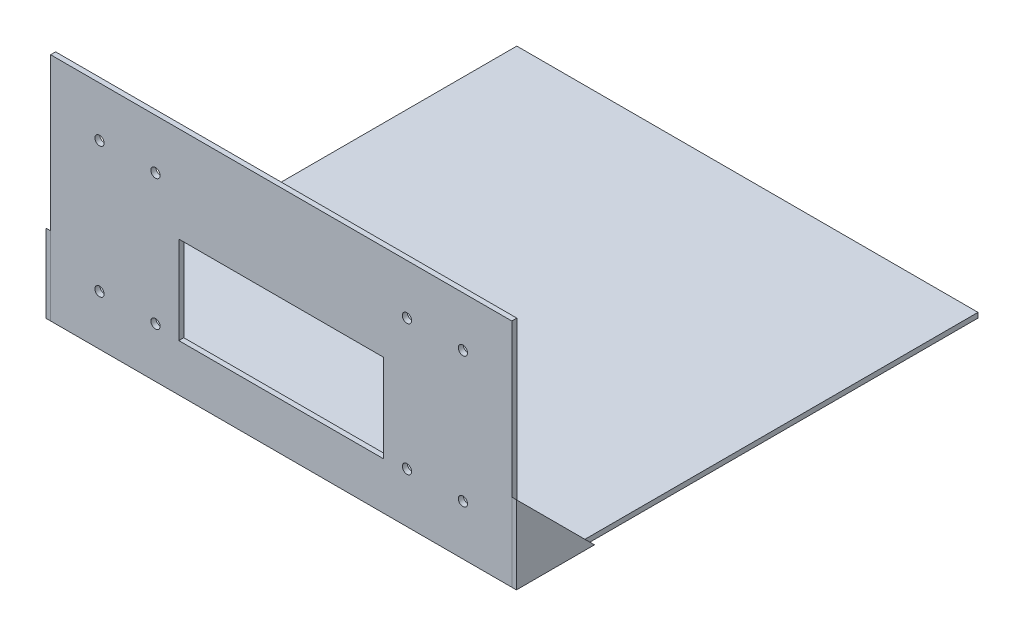
ISO-10303-21;
HEADER;
FILE_DESCRIPTION(('STEP AP214'),'2;1');
FILE_NAME('part.step','',(''),(''),'','','');
FILE_SCHEMA(('AUTOMOTIVE_DESIGN { 1 0 10303 214 1 1 1 1 }'));
ENDSEC;
DATA;
#1=APPLICATION_CONTEXT('core data for automotive mechanical design processes');
#2=APPLICATION_PROTOCOL_DEFINITION('international standard','automotive_design',2000,#1);
#3=PRODUCT_CONTEXT('',#1,'mechanical');
#4=PRODUCT('Part','Part','',(#3));
#5=PRODUCT_RELATED_PRODUCT_CATEGORY('part','',(#4));
#6=PRODUCT_DEFINITION_FORMATION('','',#4);
#7=PRODUCT_DEFINITION_CONTEXT('part definition',#1,'design');
#8=PRODUCT_DEFINITION('design','',#6,#7);
#9=PRODUCT_DEFINITION_SHAPE('','',#8);
#10=(LENGTH_UNIT() NAMED_UNIT(*) SI_UNIT(.MILLI.,.METRE.));
#11=(NAMED_UNIT(*) PLANE_ANGLE_UNIT() SI_UNIT($,.RADIAN.));
#12=(NAMED_UNIT(*) SI_UNIT($,.STERADIAN.) SOLID_ANGLE_UNIT());
#13=UNCERTAINTY_MEASURE_WITH_UNIT(LENGTH_MEASURE(1.E-05),#10,'distance_accuracy_value','');
#14=(GEOMETRIC_REPRESENTATION_CONTEXT(3) GLOBAL_UNCERTAINTY_ASSIGNED_CONTEXT((#13)) GLOBAL_UNIT_ASSIGNED_CONTEXT((#10,
#11,#12)) REPRESENTATION_CONTEXT('',''));
#15=CARTESIAN_POINT('',(0.,0.,0.));
#16=DIRECTION('',(0.,0.,1.));
#17=DIRECTION('',(1.,0.,0.));
#18=AXIS2_PLACEMENT_3D('',#15,#16,#17);
#19=CARTESIAN_POINT('',(-153.,0.,153.25));
#20=DIRECTION('',(0.,0.,1.));
#21=DIRECTION('',(-1.,0.,0.));
#22=AXIS2_PLACEMENT_3D('',#19,#20,#21);
#23=PLANE('',#22);
#24=DIRECTION('',(0.,1.,0.));
#25=VECTOR('',#24,1.);
#26=CARTESIAN_POINT('',(-150.,0.,153.25));
#27=LINE('',#26,#25);
#28=CARTESIAN_POINT('',(-150.,0.,153.25));
#29=VERTEX_POINT('',#28);
#30=CARTESIAN_POINT('',(-150.,50.8,153.25));
#31=VERTEX_POINT('',#30);
#32=EDGE_CURVE('E101',#29,#31,#27,.T.);
#33=ORIENTED_EDGE('',*,*,#32,.T.);
#34=DIRECTION('',(1.,0.,0.));
#35=VECTOR('',#34,1.);
#36=CARTESIAN_POINT('',(-153.,50.8,153.25));
#37=LINE('',#36,#35);
#38=CARTESIAN_POINT('',(-153.,50.8,153.25));
#39=VERTEX_POINT('',#38);
#40=EDGE_CURVE('E55',#39,#31,#37,.T.);
#41=ORIENTED_EDGE('',*,*,#40,.F.);
#42=DIRECTION('',(0.,1.,0.));
#43=VECTOR('',#42,1.);
#44=CARTESIAN_POINT('',(-153.,0.,153.25));
#45=LINE('',#44,#43);
#46=CARTESIAN_POINT('',(-153.,0.,153.25));
#47=VERTEX_POINT('',#46);
#48=EDGE_CURVE('E94',#47,#39,#45,.T.);
#49=ORIENTED_EDGE('',*,*,#48,.F.);
#50=DIRECTION('',(1.,0.,0.));
#51=VECTOR('',#50,1.);
#52=CARTESIAN_POINT('',(-153.,0.,153.25));
#53=LINE('',#52,#51);
#54=EDGE_CURVE('E12',#47,#29,#53,.T.);
#55=ORIENTED_EDGE('',*,*,#54,.T.);
#56=EDGE_LOOP('',(#33,#41,#49,#55));
#57=FACE_BOUND('',#56,.T.);
#58=ADVANCED_FACE('F52',(#57),#23,.T.);
#59=CARTESIAN_POINT('',(-153.,0.,102.45));
#60=DIRECTION('',(0.,-1.,0.));
#61=DIRECTION('',(0.,0.,-1.));
#62=AXIS2_PLACEMENT_3D('',#59,#60,#61);
#63=PLANE('',#62);
#64=DIRECTION('',(0.,0.,1.));
#65=VECTOR('',#64,1.);
#66=CARTESIAN_POINT('',(-150.,0.,102.45));
#67=LINE('',#66,#65);
#68=CARTESIAN_POINT('',(-150.,0.,102.45));
#69=VERTEX_POINT('',#68);
#70=EDGE_CURVE('E88',#69,#29,#67,.T.);
#71=ORIENTED_EDGE('',*,*,#70,.T.);
#72=ORIENTED_EDGE('',*,*,#54,.F.);
#73=DIRECTION('',(0.,0.,1.));
#74=VECTOR('',#73,1.);
#75=CARTESIAN_POINT('',(-153.,0.,102.45));
#76=LINE('',#75,#74);
#77=CARTESIAN_POINT('',(-153.,0.,102.45));
#78=VERTEX_POINT('',#77);
#79=EDGE_CURVE('E70',#78,#47,#76,.T.);
#80=ORIENTED_EDGE('',*,*,#79,.F.);
#81=DIRECTION('',(1.,0.,0.));
#82=VECTOR('',#81,1.);
#83=CARTESIAN_POINT('',(-153.,0.,102.45));
#84=LINE('',#83,#82);
#85=EDGE_CURVE('E61',#78,#69,#84,.T.);
#86=ORIENTED_EDGE('',*,*,#85,.T.);
#87=EDGE_LOOP('',(#71,#72,#80,#86));
#88=FACE_BOUND('',#87,.T.);
#89=ADVANCED_FACE('F106',(#88),#63,.T.);
#90=CARTESIAN_POINT('',(-153.,50.8,153.25));
#91=DIRECTION('',(0.,0.707106781186547,-0.707106781186548));
#92=DIRECTION('',(0.,0.707106781186548,0.707106781186547));
#93=AXIS2_PLACEMENT_3D('',#90,#91,#92);
#94=PLANE('',#93);
#95=DIRECTION('',(0.,-0.707106781186548,-0.707106781186547));
#96=VECTOR('',#95,1.);
#97=CARTESIAN_POINT('',(-150.,50.8,153.25));
#98=LINE('',#97,#96);
#99=EDGE_CURVE('E83',#31,#69,#98,.T.);
#100=ORIENTED_EDGE('',*,*,#99,.T.);
#101=ORIENTED_EDGE('',*,*,#85,.F.);
#102=DIRECTION('',(0.,-0.707106781186548,-0.707106781186547));
#103=VECTOR('',#102,1.);
#104=CARTESIAN_POINT('',(-153.,50.8,153.25));
#105=LINE('',#104,#103);
#106=EDGE_CURVE('E90',#39,#78,#105,.T.);
#107=ORIENTED_EDGE('',*,*,#106,.F.);
#108=ORIENTED_EDGE('',*,*,#40,.T.);
#109=EDGE_LOOP('',(#100,#101,#107,#108));
#110=FACE_BOUND('',#109,.T.);
#111=ADVANCED_FACE('F91',(#110),#94,.T.);
#112=CARTESIAN_POINT('',(-153.,0.,0.));
#113=DIRECTION('',(-1.,0.,0.));
#114=DIRECTION('',(0.,0.,-1.));
#115=AXIS2_PLACEMENT_3D('',#112,#113,#114);
#116=PLANE('',#115);
#117=ORIENTED_EDGE('',*,*,#48,.T.);
#118=ORIENTED_EDGE('',*,*,#106,.T.);
#119=ORIENTED_EDGE('',*,*,#79,.T.);
#120=EDGE_LOOP('',(#117,#118,#119));
#121=FACE_BOUND('',#120,.T.);
#122=ADVANCED_FACE('F97',(#121),#116,.T.);
#123=CARTESIAN_POINT('',(-150.,0.,0.));
#124=DIRECTION('',(-1.,0.,0.));
#125=DIRECTION('',(0.,0.,-1.));
#126=AXIS2_PLACEMENT_3D('',#123,#124,#125);
#127=PLANE('',#126);
#128=ORIENTED_EDGE('',*,*,#32,.F.);
#129=ORIENTED_EDGE('',*,*,#70,.F.);
#130=ORIENTED_EDGE('',*,*,#99,.F.);
#131=EDGE_LOOP('',(#128,#129,#130));
#132=FACE_BOUND('',#131,.T.);
#133=ADVANCED_FACE('F108',(#132),#127,.F.);
#134=CLOSED_SHELL('',(#58,#89,#111,#122,#133));
#135=MANIFOLD_SOLID_BREP('B2',#134);
#136=CARTESIAN_POINT('',(153.,0.,153.25));
#137=DIRECTION('',(0.,0.,1.));
#138=DIRECTION('',(1.,0.,0.));
#139=AXIS2_PLACEMENT_3D('',#136,#137,#138);
#140=PLANE('',#139);
#141=DIRECTION('',(0.,1.,0.));
#142=VECTOR('',#141,1.);
#143=CARTESIAN_POINT('',(150.,0.,153.25));
#144=LINE('',#143,#142);
#145=CARTESIAN_POINT('',(150.,0.,153.25));
#146=VERTEX_POINT('',#145);
#147=CARTESIAN_POINT('',(150.,50.8,153.25));
#148=VERTEX_POINT('',#147);
#149=EDGE_CURVE('E212',#146,#148,#144,.T.);
#150=ORIENTED_EDGE('',*,*,#149,.F.);
#151=DIRECTION('',(-1.,0.,0.));
#152=VECTOR('',#151,1.);
#153=CARTESIAN_POINT('',(153.,0.,153.25));
#154=LINE('',#153,#152);
#155=CARTESIAN_POINT('',(153.,0.,153.25));
#156=VERTEX_POINT('',#155);
#157=EDGE_CURVE('E50',#156,#146,#154,.T.);
#158=ORIENTED_EDGE('',*,*,#157,.F.);
#159=DIRECTION('',(0.,1.,0.));
#160=VECTOR('',#159,1.);
#161=CARTESIAN_POINT('',(153.,0.,153.25));
#162=LINE('',#161,#160);
#163=CARTESIAN_POINT('',(153.,50.8,153.25));
#164=VERTEX_POINT('',#163);
#165=EDGE_CURVE('E204',#156,#164,#162,.T.);
#166=ORIENTED_EDGE('',*,*,#165,.T.);
#167=DIRECTION('',(-1.,0.,0.));
#168=VECTOR('',#167,1.);
#169=CARTESIAN_POINT('',(153.,50.8,153.25));
#170=LINE('',#169,#168);
#171=EDGE_CURVE('E163',#164,#148,#170,.T.);
#172=ORIENTED_EDGE('',*,*,#171,.T.);
#173=EDGE_LOOP('',(#150,#158,#166,#172));
#174=FACE_BOUND('',#173,.T.);
#175=ADVANCED_FACE('F160',(#174),#140,.T.);
#176=CARTESIAN_POINT('',(153.,0.,102.45));
#177=DIRECTION('',(0.,-1.,0.));
#178=DIRECTION('',(0.,0.,-1.));
#179=AXIS2_PLACEMENT_3D('',#176,#177,#178);
#180=PLANE('',#179);
#181=DIRECTION('',(0.,0.,1.));
#182=VECTOR('',#181,1.);
#183=CARTESIAN_POINT('',(150.,0.,102.45));
#184=LINE('',#183,#182);
#185=CARTESIAN_POINT('',(150.,0.,102.45));
#186=VERTEX_POINT('',#185);
#187=EDGE_CURVE('E206',#186,#146,#184,.T.);
#188=ORIENTED_EDGE('',*,*,#187,.F.);
#189=DIRECTION('',(-1.,0.,0.));
#190=VECTOR('',#189,1.);
#191=CARTESIAN_POINT('',(153.,0.,102.45));
#192=LINE('',#191,#190);
#193=CARTESIAN_POINT('',(153.,0.,102.45));
#194=VERTEX_POINT('',#193);
#195=EDGE_CURVE('E169',#194,#186,#192,.T.);
#196=ORIENTED_EDGE('',*,*,#195,.F.);
#197=DIRECTION('',(0.,0.,1.));
#198=VECTOR('',#197,1.);
#199=CARTESIAN_POINT('',(153.,0.,102.45));
#200=LINE('',#199,#198);
#201=EDGE_CURVE('E201',#194,#156,#200,.T.);
#202=ORIENTED_EDGE('',*,*,#201,.T.);
#203=ORIENTED_EDGE('',*,*,#157,.T.);
#204=EDGE_LOOP('',(#188,#196,#202,#203));
#205=FACE_BOUND('',#204,.T.);
#206=ADVANCED_FACE('F216',(#205),#180,.T.);
#207=CARTESIAN_POINT('',(153.,50.8,153.25));
#208=DIRECTION('',(0.,0.707106781186547,-0.707106781186548));
#209=DIRECTION('',(0.,0.707106781186548,0.707106781186547));
#210=AXIS2_PLACEMENT_3D('',#207,#208,#209);
#211=PLANE('',#210);
#212=DIRECTION('',(0.,-0.707106781186548,-0.707106781186547));
#213=VECTOR('',#212,1.);
#214=CARTESIAN_POINT('',(150.,50.8,153.25));
#215=LINE('',#214,#213);
#216=EDGE_CURVE('E199',#148,#186,#215,.T.);
#217=ORIENTED_EDGE('',*,*,#216,.F.);
#218=ORIENTED_EDGE('',*,*,#171,.F.);
#219=DIRECTION('',(0.,-0.707106781186548,-0.707106781186547));
#220=VECTOR('',#219,1.);
#221=CARTESIAN_POINT('',(153.,50.8,153.25));
#222=LINE('',#221,#220);
#223=EDGE_CURVE('E197',#164,#194,#222,.T.);
#224=ORIENTED_EDGE('',*,*,#223,.T.);
#225=ORIENTED_EDGE('',*,*,#195,.T.);
#226=EDGE_LOOP('',(#217,#218,#224,#225));
#227=FACE_BOUND('',#226,.T.);
#228=ADVANCED_FACE('F196',(#227),#211,.T.);
#229=CARTESIAN_POINT('',(153.,0.,0.));
#230=DIRECTION('',(1.,0.,0.));
#231=DIRECTION('',(0.,0.,-1.));
#232=AXIS2_PLACEMENT_3D('',#229,#230,#231);
#233=PLANE('',#232);
#234=ORIENTED_EDGE('',*,*,#165,.F.);
#235=ORIENTED_EDGE('',*,*,#201,.F.);
#236=ORIENTED_EDGE('',*,*,#223,.F.);
#237=EDGE_LOOP('',(#234,#235,#236));
#238=FACE_BOUND('',#237,.T.);
#239=ADVANCED_FACE('F203',(#238),#233,.T.);
#240=CARTESIAN_POINT('',(150.,0.,0.));
#241=DIRECTION('',(1.,0.,0.));
#242=DIRECTION('',(0.,0.,-1.));
#243=AXIS2_PLACEMENT_3D('',#240,#241,#242);
#244=PLANE('',#243);
#245=ORIENTED_EDGE('',*,*,#149,.T.);
#246=ORIENTED_EDGE('',*,*,#216,.T.);
#247=ORIENTED_EDGE('',*,*,#187,.T.);
#248=EDGE_LOOP('',(#245,#246,#247));
#249=FACE_BOUND('',#248,.T.);
#250=ADVANCED_FACE('F215',(#249),#244,.F.);
#251=CLOSED_SHELL('',(#175,#206,#228,#239,#250));
#252=MANIFOLD_SOLID_BREP('B6',#251);
#253=CARTESIAN_POINT('',(150.,0.,153.25));
#254=DIRECTION('',(-1.,0.,0.));
#255=DIRECTION('',(0.,0.,1.));
#256=AXIS2_PLACEMENT_3D('',#253,#254,#255);
#257=PLANE('',#256);
#258=DIRECTION('',(0.,1.,0.));
#259=VECTOR('',#258,1.);
#260=CARTESIAN_POINT('',(150.,0.,150.));
#261=LINE('',#260,#259);
#262=CARTESIAN_POINT('',(150.,0.,150.));
#263=VERTEX_POINT('',#262);
#264=CARTESIAN_POINT('',(150.,150.,150.));
#265=VERTEX_POINT('',#264);
#266=EDGE_CURVE('E379',#263,#265,#261,.T.);
#267=ORIENTED_EDGE('',*,*,#266,.T.);
#268=DIRECTION('',(0.,0.,-1.));
#269=VECTOR('',#268,1.);
#270=CARTESIAN_POINT('',(150.,150.,153.25));
#271=LINE('',#270,#269);
#272=CARTESIAN_POINT('',(150.,150.,153.25));
#273=VERTEX_POINT('',#272);
#274=EDGE_CURVE('E158',#273,#265,#271,.T.);
#275=ORIENTED_EDGE('',*,*,#274,.F.);
#276=DIRECTION('',(0.,1.,0.));
#277=VECTOR('',#276,1.);
#278=CARTESIAN_POINT('',(150.,0.,153.25));
#279=LINE('',#278,#277);
#280=CARTESIAN_POINT('',(150.,0.,153.25));
#281=VERTEX_POINT('',#280);
#282=EDGE_CURVE('E383',#281,#273,#279,.T.);
#283=ORIENTED_EDGE('',*,*,#282,.F.);
#284=DIRECTION('',(0.,0.,-1.));
#285=VECTOR('',#284,1.);
#286=CARTESIAN_POINT('',(150.,0.,153.25));
#287=LINE('',#286,#285);
#288=EDGE_CURVE('E395',#281,#263,#287,.T.);
#289=ORIENTED_EDGE('',*,*,#288,.T.);
#290=EDGE_LOOP('',(#267,#275,#283,#289));
#291=FACE_BOUND('',#290,.T.);
#292=ADVANCED_FACE('F267',(#291),#257,.F.);
#293=CARTESIAN_POINT('',(150.,150.,153.25));
#294=DIRECTION('',(0.,-1.,0.));
#295=DIRECTION('',(1.,0.,0.));
#296=AXIS2_PLACEMENT_3D('',#293,#294,#295);
#297=PLANE('',#296);
#298=DIRECTION('',(-1.,0.,0.));
#299=VECTOR('',#298,1.);
#300=CARTESIAN_POINT('',(150.,150.,150.));
#301=LINE('',#300,#299);
#302=CARTESIAN_POINT('',(-150.,150.,150.));
#303=VERTEX_POINT('',#302);
#304=EDGE_CURVE('E398',#265,#303,#301,.T.);
#305=ORIENTED_EDGE('',*,*,#304,.T.);
#306=DIRECTION('',(0.,0.,-1.));
#307=VECTOR('',#306,1.);
#308=CARTESIAN_POINT('',(-150.,150.,153.25));
#309=LINE('',#308,#307);
#310=CARTESIAN_POINT('',(-150.,150.,153.25));
#311=VERTEX_POINT('',#310);
#312=EDGE_CURVE('E275',#311,#303,#309,.T.);
#313=ORIENTED_EDGE('',*,*,#312,.F.);
#314=DIRECTION('',(-1.,0.,0.));
#315=VECTOR('',#314,1.);
#316=CARTESIAN_POINT('',(150.,150.,153.25));
#317=LINE('',#316,#315);
#318=EDGE_CURVE('E386',#273,#311,#317,.T.);
#319=ORIENTED_EDGE('',*,*,#318,.F.);
#320=ORIENTED_EDGE('',*,*,#274,.T.);
#321=EDGE_LOOP('',(#305,#313,#319,#320));
#322=FACE_BOUND('',#321,.T.);
#323=ADVANCED_FACE('F461',(#322),#297,.F.);
#324=CARTESIAN_POINT('',(-150.,0.,153.25));
#325=DIRECTION('',(1.,0.,0.));
#326=DIRECTION('',(0.,0.,-1.));
#327=AXIS2_PLACEMENT_3D('',#324,#325,#326);
#328=PLANE('',#327);
#329=DIRECTION('',(0.,-1.,0.));
#330=VECTOR('',#329,1.);
#331=CARTESIAN_POINT('',(-150.,0.,150.));
#332=LINE('',#331,#330);
#333=CARTESIAN_POINT('',(-150.,0.,150.));
#334=VERTEX_POINT('',#333);
#335=EDGE_CURVE('E401',#303,#334,#332,.T.);
#336=ORIENTED_EDGE('',*,*,#335,.T.);
#337=DIRECTION('',(0.,0.,-1.));
#338=VECTOR('',#337,1.);
#339=CARTESIAN_POINT('',(-150.,0.,153.25));
#340=LINE('',#339,#338);
#341=CARTESIAN_POINT('',(-150.,0.,153.25));
#342=VERTEX_POINT('',#341);
#343=EDGE_CURVE('E407',#342,#334,#340,.T.);
#344=ORIENTED_EDGE('',*,*,#343,.F.);
#345=DIRECTION('',(0.,-1.,0.));
#346=VECTOR('',#345,1.);
#347=CARTESIAN_POINT('',(-150.,0.,153.25));
#348=LINE('',#347,#346);
#349=EDGE_CURVE('E390',#311,#342,#348,.T.);
#350=ORIENTED_EDGE('',*,*,#349,.F.);
#351=ORIENTED_EDGE('',*,*,#312,.T.);
#352=EDGE_LOOP('',(#336,#344,#350,#351));
#353=FACE_BOUND('',#352,.T.);
#354=ADVANCED_FACE('F466',(#353),#328,.F.);
#355=CARTESIAN_POINT('',(150.,0.,153.25));
#356=DIRECTION('',(0.,1.,0.));
#357=DIRECTION('',(0.,0.,1.));
#358=AXIS2_PLACEMENT_3D('',#355,#356,#357);
#359=PLANE('',#358);
#360=DIRECTION('',(1.,0.,0.));
#361=VECTOR('',#360,1.);
#362=CARTESIAN_POINT('',(150.,0.,150.));
#363=LINE('',#362,#361);
#364=EDGE_CURVE('E387',#334,#263,#363,.T.);
#365=ORIENTED_EDGE('',*,*,#364,.T.);
#366=ORIENTED_EDGE('',*,*,#288,.F.);
#367=DIRECTION('',(1.,0.,0.));
#368=VECTOR('',#367,1.);
#369=CARTESIAN_POINT('',(150.,0.,153.25));
#370=LINE('',#369,#368);
#371=EDGE_CURVE('E393',#342,#281,#370,.T.);
#372=ORIENTED_EDGE('',*,*,#371,.F.);
#373=ORIENTED_EDGE('',*,*,#343,.T.);
#374=EDGE_LOOP('',(#365,#366,#372,#373));
#375=FACE_BOUND('',#374,.T.);
#376=ADVANCED_FACE('F448',(#375),#359,.F.);
#377=CARTESIAN_POINT('',(0.,0.,153.25));
#378=DIRECTION('',(0.,0.,1.));
#379=DIRECTION('',(1.,0.,0.));
#380=AXIS2_PLACEMENT_3D('',#377,#378,#379);
#381=PLANE('',#380);
#382=CARTESIAN_POINT('',(118.203411960363,117.56753958833,153.25));
#383=DIRECTION('',(0.,0.,1.));
#384=DIRECTION('',(1.,0.,0.));
#385=AXIS2_PLACEMENT_3D('',#382,#383,#384);
#386=CIRCLE('',#385,3.00000000000001);
#387=CARTESIAN_POINT('',(121.203411960363,117.56753958833,153.25));
#388=VERTEX_POINT('',#387);
#389=EDGE_CURVE('E420',#388,#388,#386,.T.);
#390=ORIENTED_EDGE('',*,*,#389,.F.);
#391=EDGE_LOOP('',(#390));
#392=FACE_BOUND('',#391,.T.);
#393=CARTESIAN_POINT('',(118.203411960363,32.5675395883299,153.25));
#394=DIRECTION('',(0.,0.,1.));
#395=DIRECTION('',(1.,0.,0.));
#396=AXIS2_PLACEMENT_3D('',#393,#394,#395);
#397=CIRCLE('',#396,3.00000000000001);
#398=CARTESIAN_POINT('',(121.203411960363,32.5675395883299,153.25));
#399=VERTEX_POINT('',#398);
#400=EDGE_CURVE('E620',#399,#399,#397,.T.);
#401=ORIENTED_EDGE('',*,*,#400,.F.);
#402=EDGE_LOOP('',(#401));
#403=FACE_BOUND('',#402,.T.);
#404=CARTESIAN_POINT('',(81.7965880396367,32.5675395883299,153.25));
#405=DIRECTION('',(0.,0.,1.));
#406=DIRECTION('',(1.,0.,0.));
#407=AXIS2_PLACEMENT_3D('',#404,#405,#406);
#408=CIRCLE('',#407,3.00000000000001);
#409=CARTESIAN_POINT('',(84.7965880396367,32.5675395883299,153.25));
#410=VERTEX_POINT('',#409);
#411=EDGE_CURVE('E623',#410,#410,#408,.T.);
#412=ORIENTED_EDGE('',*,*,#411,.F.);
#413=EDGE_LOOP('',(#412));
#414=FACE_BOUND('',#413,.T.);
#415=CARTESIAN_POINT('',(-81.7965880396367,32.5675395883299,153.25));
#416=DIRECTION('',(0.,0.,1.));
#417=DIRECTION('',(1.,0.,0.));
#418=AXIS2_PLACEMENT_3D('',#415,#416,#417);
#419=CIRCLE('',#418,3.00000000000001);
#420=CARTESIAN_POINT('',(-78.7965880396367,32.5675395883299,153.25));
#421=VERTEX_POINT('',#420);
#422=EDGE_CURVE('E628',#421,#421,#419,.T.);
#423=ORIENTED_EDGE('',*,*,#422,.F.);
#424=EDGE_LOOP('',(#423));
#425=FACE_BOUND('',#424,.T.);
#426=CARTESIAN_POINT('',(-118.203411960363,32.5675395883299,153.25));
#427=DIRECTION('',(0.,0.,1.));
#428=DIRECTION('',(1.,0.,0.));
#429=AXIS2_PLACEMENT_3D('',#426,#427,#428);
#430=CIRCLE('',#429,3.00000000000001);
#431=CARTESIAN_POINT('',(-115.203411960363,32.5675395883299,153.25));
#432=VERTEX_POINT('',#431);
#433=EDGE_CURVE('E631',#432,#432,#430,.T.);
#434=ORIENTED_EDGE('',*,*,#433,.F.);
#435=EDGE_LOOP('',(#434));
#436=FACE_BOUND('',#435,.T.);
#437=CARTESIAN_POINT('',(-118.203411960363,117.56753958833,153.25));
#438=DIRECTION('',(0.,0.,1.));
#439=DIRECTION('',(1.,0.,0.));
#440=AXIS2_PLACEMENT_3D('',#437,#438,#439);
#441=CIRCLE('',#440,3.00000000000001);
#442=CARTESIAN_POINT('',(-115.203411960363,117.56753958833,153.25));
#443=VERTEX_POINT('',#442);
#444=EDGE_CURVE('E634',#443,#443,#441,.T.);
#445=ORIENTED_EDGE('',*,*,#444,.F.);
#446=EDGE_LOOP('',(#445));
#447=FACE_BOUND('',#446,.T.);
#448=CARTESIAN_POINT('',(-81.7965880396367,117.56753958833,153.25));
#449=DIRECTION('',(0.,0.,1.));
#450=DIRECTION('',(1.,0.,0.));
#451=AXIS2_PLACEMENT_3D('',#448,#449,#450);
#452=CIRCLE('',#451,3.00000000000001);
#453=CARTESIAN_POINT('',(-78.7965880396367,117.56753958833,153.25));
#454=VERTEX_POINT('',#453);
#455=EDGE_CURVE('E637',#454,#454,#452,.T.);
#456=ORIENTED_EDGE('',*,*,#455,.F.);
#457=EDGE_LOOP('',(#456));
#458=FACE_BOUND('',#457,.T.);
#459=CARTESIAN_POINT('',(81.7965880396367,117.56753958833,153.25));
#460=DIRECTION('',(0.,0.,1.));
#461=DIRECTION('',(1.,0.,0.));
#462=AXIS2_PLACEMENT_3D('',#459,#460,#461);
#463=CIRCLE('',#462,3.00000000000001);
#464=CARTESIAN_POINT('',(84.7965880396367,117.56753958833,153.25));
#465=VERTEX_POINT('',#464);
#466=EDGE_CURVE('E364',#465,#465,#463,.T.);
#467=ORIENTED_EDGE('',*,*,#466,.F.);
#468=EDGE_LOOP('',(#467));
#469=FACE_BOUND('',#468,.T.);
#470=DIRECTION('',(0.,-1.,0.));
#471=VECTOR('',#470,1.);
#472=CARTESIAN_POINT('',(-66.6162905771802,30.650602214716,153.25));
#473=LINE('',#472,#471);
#474=CARTESIAN_POINT('',(-66.6162905771802,87.8493812812109,153.25));
#475=VERTEX_POINT('',#474);
#476=CARTESIAN_POINT('',(-66.6162905771802,30.650602214716,153.25));
#477=VERTEX_POINT('',#476);
#478=EDGE_CURVE('E283',#475,#477,#473,.T.);
#479=ORIENTED_EDGE('',*,*,#478,.F.);
#480=DIRECTION('',(-1.,0.,0.));
#481=VECTOR('',#480,1.);
#482=CARTESIAN_POINT('',(66.6162905742886,87.849381281211,153.25));
#483=LINE('',#482,#481);
#484=CARTESIAN_POINT('',(66.6162905742886,87.849381281211,153.25));
#485=VERTEX_POINT('',#484);
#486=EDGE_CURVE('E356',#485,#475,#483,.T.);
#487=ORIENTED_EDGE('',*,*,#486,.F.);
#488=DIRECTION('',(0.,1.,0.));
#489=VECTOR('',#488,1.);
#490=CARTESIAN_POINT('',(66.6162905742886,30.650602214716,153.25));
#491=LINE('',#490,#489);
#492=CARTESIAN_POINT('',(66.6162905742886,30.650602214716,153.25));
#493=VERTEX_POINT('',#492);
#494=EDGE_CURVE('E361',#493,#485,#491,.T.);
#495=ORIENTED_EDGE('',*,*,#494,.F.);
#496=DIRECTION('',(1.,0.,0.));
#497=VECTOR('',#496,1.);
#498=CARTESIAN_POINT('',(66.6162905742886,30.650602214716,153.25));
#499=LINE('',#498,#497);
#500=EDGE_CURVE('E371',#477,#493,#499,.T.);
#501=ORIENTED_EDGE('',*,*,#500,.F.);
#502=EDGE_LOOP('',(#479,#487,#495,#501));
#503=FACE_BOUND('',#502,.T.);
#504=ORIENTED_EDGE('',*,*,#282,.T.);
#505=ORIENTED_EDGE('',*,*,#318,.T.);
#506=ORIENTED_EDGE('',*,*,#349,.T.);
#507=ORIENTED_EDGE('',*,*,#371,.T.);
#508=EDGE_LOOP('',(#504,#505,#506,#507));
#509=FACE_BOUND('',#508,.T.);
#510=ADVANCED_FACE('F445',(#392,#403,#414,#425,#436,#447,#458,#469,#503,#509),#381,.T.);
#511=CARTESIAN_POINT('',(0.,0.,150.));
#512=DIRECTION('',(0.,0.,1.));
#513=DIRECTION('',(1.,0.,0.));
#514=AXIS2_PLACEMENT_3D('',#511,#512,#513);
#515=PLANE('',#514);
#516=CARTESIAN_POINT('',(118.203411960363,117.56753958833,150.));
#517=DIRECTION('',(0.,0.,1.));
#518=DIRECTION('',(1.,0.,0.));
#519=AXIS2_PLACEMENT_3D('',#516,#517,#518);
#520=CIRCLE('',#519,3.00000000000001);
#521=CARTESIAN_POINT('',(121.203411960363,117.56753958833,150.));
#522=VERTEX_POINT('',#521);
#523=EDGE_CURVE('E270',#522,#522,#520,.F.);
#524=ORIENTED_EDGE('',*,*,#523,.F.);
#525=EDGE_LOOP('',(#524));
#526=FACE_BOUND('',#525,.T.);
#527=CARTESIAN_POINT('',(118.203411960363,32.5675395883299,150.));
#528=DIRECTION('',(0.,0.,1.));
#529=DIRECTION('',(1.,0.,0.));
#530=AXIS2_PLACEMENT_3D('',#527,#528,#529);
#531=CIRCLE('',#530,3.00000000000001);
#532=CARTESIAN_POINT('',(121.203411960363,32.5675395883299,150.));
#533=VERTEX_POINT('',#532);
#534=EDGE_CURVE('E432',#533,#533,#531,.F.);
#535=ORIENTED_EDGE('',*,*,#534,.F.);
#536=EDGE_LOOP('',(#535));
#537=FACE_BOUND('',#536,.T.);
#538=CARTESIAN_POINT('',(81.7965880396367,32.5675395883299,150.));
#539=DIRECTION('',(0.,0.,1.));
#540=DIRECTION('',(1.,0.,0.));
#541=AXIS2_PLACEMENT_3D('',#538,#539,#540);
#542=CIRCLE('',#541,3.00000000000001);
#543=CARTESIAN_POINT('',(84.7965880396367,32.5675395883299,150.));
#544=VERTEX_POINT('',#543);
#545=EDGE_CURVE('E430',#544,#544,#542,.F.);
#546=ORIENTED_EDGE('',*,*,#545,.F.);
#547=EDGE_LOOP('',(#546));
#548=FACE_BOUND('',#547,.T.);
#549=CARTESIAN_POINT('',(-81.7965880396367,32.5675395883299,150.));
#550=DIRECTION('',(0.,0.,1.));
#551=DIRECTION('',(1.,0.,0.));
#552=AXIS2_PLACEMENT_3D('',#549,#550,#551);
#553=CIRCLE('',#552,3.00000000000001);
#554=CARTESIAN_POINT('',(-78.7965880396367,32.5675395883299,150.));
#555=VERTEX_POINT('',#554);
#556=EDGE_CURVE('E427',#555,#555,#553,.F.);
#557=ORIENTED_EDGE('',*,*,#556,.F.);
#558=EDGE_LOOP('',(#557));
#559=FACE_BOUND('',#558,.T.);
#560=CARTESIAN_POINT('',(-118.203411960363,32.5675395883299,150.));
#561=DIRECTION('',(0.,0.,1.));
#562=DIRECTION('',(1.,0.,0.));
#563=AXIS2_PLACEMENT_3D('',#560,#561,#562);
#564=CIRCLE('',#563,3.00000000000001);
#565=CARTESIAN_POINT('',(-115.203411960363,32.5675395883299,150.));
#566=VERTEX_POINT('',#565);
#567=EDGE_CURVE('E424',#566,#566,#564,.F.);
#568=ORIENTED_EDGE('',*,*,#567,.F.);
#569=EDGE_LOOP('',(#568));
#570=FACE_BOUND('',#569,.T.);
#571=CARTESIAN_POINT('',(-118.203411960363,117.56753958833,150.));
#572=DIRECTION('',(0.,0.,1.));
#573=DIRECTION('',(1.,0.,0.));
#574=AXIS2_PLACEMENT_3D('',#571,#572,#573);
#575=CIRCLE('',#574,3.00000000000001);
#576=CARTESIAN_POINT('',(-115.203411960363,117.56753958833,150.));
#577=VERTEX_POINT('',#576);
#578=EDGE_CURVE('E419',#577,#577,#575,.F.);
#579=ORIENTED_EDGE('',*,*,#578,.F.);
#580=EDGE_LOOP('',(#579));
#581=FACE_BOUND('',#580,.T.);
#582=CARTESIAN_POINT('',(-81.7965880396367,117.56753958833,150.));
#583=DIRECTION('',(0.,0.,1.));
#584=DIRECTION('',(1.,0.,0.));
#585=AXIS2_PLACEMENT_3D('',#582,#583,#584);
#586=CIRCLE('',#585,3.00000000000001);
#587=CARTESIAN_POINT('',(-78.7965880396367,117.56753958833,150.));
#588=VERTEX_POINT('',#587);
#589=EDGE_CURVE('E415',#588,#588,#586,.F.);
#590=ORIENTED_EDGE('',*,*,#589,.F.);
#591=EDGE_LOOP('',(#590));
#592=FACE_BOUND('',#591,.T.);
#593=CARTESIAN_POINT('',(81.7965880396367,117.56753958833,150.));
#594=DIRECTION('',(0.,0.,1.));
#595=DIRECTION('',(1.,0.,0.));
#596=AXIS2_PLACEMENT_3D('',#593,#594,#595);
#597=CIRCLE('',#596,3.00000000000001);
#598=CARTESIAN_POINT('',(84.7965880396367,117.56753958833,150.));
#599=VERTEX_POINT('',#598);
#600=EDGE_CURVE('E372',#599,#599,#597,.F.);
#601=ORIENTED_EDGE('',*,*,#600,.F.);
#602=EDGE_LOOP('',(#601));
#603=FACE_BOUND('',#602,.T.);
#604=DIRECTION('',(-1.,0.,0.));
#605=VECTOR('',#604,1.);
#606=CARTESIAN_POINT('',(66.6162905742886,87.849381281211,150.));
#607=LINE('',#606,#605);
#608=CARTESIAN_POINT('',(66.6162905742886,87.849381281211,150.));
#609=VERTEX_POINT('',#608);
#610=CARTESIAN_POINT('',(-66.6162905771802,87.8493812812109,150.));
#611=VERTEX_POINT('',#610);
#612=EDGE_CURVE('E345',#609,#611,#607,.T.);
#613=ORIENTED_EDGE('',*,*,#612,.T.);
#614=DIRECTION('',(0.,-1.,0.));
#615=VECTOR('',#614,1.);
#616=CARTESIAN_POINT('',(-66.6162905771802,30.650602214716,150.));
#617=LINE('',#616,#615);
#618=CARTESIAN_POINT('',(-66.6162905771802,30.650602214716,150.));
#619=VERTEX_POINT('',#618);
#620=EDGE_CURVE('E339',#611,#619,#617,.T.);
#621=ORIENTED_EDGE('',*,*,#620,.T.);
#622=DIRECTION('',(1.,0.,0.));
#623=VECTOR('',#622,1.);
#624=CARTESIAN_POINT('',(66.6162905742886,30.650602214716,150.));
#625=LINE('',#624,#623);
#626=CARTESIAN_POINT('',(66.6162905742886,30.650602214716,150.));
#627=VERTEX_POINT('',#626);
#628=EDGE_CURVE('E348',#619,#627,#625,.T.);
#629=ORIENTED_EDGE('',*,*,#628,.T.);
#630=DIRECTION('',(0.,1.,0.));
#631=VECTOR('',#630,1.);
#632=CARTESIAN_POINT('',(66.6162905742886,30.650602214716,150.));
#633=LINE('',#632,#631);
#634=EDGE_CURVE('E291',#627,#609,#633,.T.);
#635=ORIENTED_EDGE('',*,*,#634,.T.);
#636=EDGE_LOOP('',(#613,#621,#629,#635));
#637=FACE_BOUND('',#636,.T.);
#638=ORIENTED_EDGE('',*,*,#266,.F.);
#639=ORIENTED_EDGE('',*,*,#364,.F.);
#640=ORIENTED_EDGE('',*,*,#335,.F.);
#641=ORIENTED_EDGE('',*,*,#304,.F.);
#642=EDGE_LOOP('',(#638,#639,#640,#641));
#643=FACE_BOUND('',#642,.T.);
#644=ADVANCED_FACE('F352',(#526,#537,#548,#559,#570,#581,#592,#603,#637,#643),#515,.F.);
#645=CARTESIAN_POINT('',(-66.6162905771802,30.650602214716,150.));
#646=DIRECTION('',(-1.,0.,0.));
#647=DIRECTION('',(0.,0.,1.));
#648=AXIS2_PLACEMENT_3D('',#645,#646,#647);
#649=PLANE('',#648);
#650=ORIENTED_EDGE('',*,*,#478,.T.);
#651=DIRECTION('',(0.,0.,1.));
#652=VECTOR('',#651,1.);
#653=CARTESIAN_POINT('',(-66.6162905771802,30.650602214716,150.));
#654=LINE('',#653,#652);
#655=EDGE_CURVE('E335',#619,#477,#654,.T.);
#656=ORIENTED_EDGE('',*,*,#655,.F.);
#657=ORIENTED_EDGE('',*,*,#620,.F.);
#658=DIRECTION('',(0.,0.,1.));
#659=VECTOR('',#658,1.);
#660=CARTESIAN_POINT('',(-66.6162905771802,87.8493812812109,150.));
#661=LINE('',#660,#659);
#662=EDGE_CURVE('E376',#611,#475,#661,.T.);
#663=ORIENTED_EDGE('',*,*,#662,.T.);
#664=EDGE_LOOP('',(#650,#656,#657,#663));
#665=FACE_BOUND('',#664,.T.);
#666=ADVANCED_FACE('F337',(#665),#649,.F.);
#667=CARTESIAN_POINT('',(66.6162905742886,87.849381281211,150.));
#668=DIRECTION('',(0.,1.,0.));
#669=DIRECTION('',(-1.,0.,0.));
#670=AXIS2_PLACEMENT_3D('',#667,#668,#669);
#671=PLANE('',#670);
#672=ORIENTED_EDGE('',*,*,#486,.T.);
#673=ORIENTED_EDGE('',*,*,#662,.F.);
#674=ORIENTED_EDGE('',*,*,#612,.F.);
#675=DIRECTION('',(0.,0.,1.));
#676=VECTOR('',#675,1.);
#677=CARTESIAN_POINT('',(66.6162905742886,87.849381281211,150.));
#678=LINE('',#677,#676);
#679=EDGE_CURVE('E380',#609,#485,#678,.T.);
#680=ORIENTED_EDGE('',*,*,#679,.T.);
#681=EDGE_LOOP('',(#672,#673,#674,#680));
#682=FACE_BOUND('',#681,.T.);
#683=ADVANCED_FACE('F475',(#682),#671,.F.);
#684=CARTESIAN_POINT('',(66.6162905742886,30.650602214716,150.));
#685=DIRECTION('',(1.,0.,0.));
#686=DIRECTION('',(0.,0.,-1.));
#687=AXIS2_PLACEMENT_3D('',#684,#685,#686);
#688=PLANE('',#687);
#689=ORIENTED_EDGE('',*,*,#494,.T.);
#690=ORIENTED_EDGE('',*,*,#679,.F.);
#691=ORIENTED_EDGE('',*,*,#634,.F.);
#692=DIRECTION('',(0.,0.,1.));
#693=VECTOR('',#692,1.);
#694=CARTESIAN_POINT('',(66.6162905742886,30.650602214716,150.));
#695=LINE('',#694,#693);
#696=EDGE_CURVE('E344',#627,#493,#695,.T.);
#697=ORIENTED_EDGE('',*,*,#696,.T.);
#698=EDGE_LOOP('',(#689,#690,#691,#697));
#699=FACE_BOUND('',#698,.T.);
#700=ADVANCED_FACE('F594',(#699),#688,.F.);
#701=CARTESIAN_POINT('',(66.6162905742886,30.650602214716,150.));
#702=DIRECTION('',(0.,-1.,0.));
#703=DIRECTION('',(1.,0.,0.));
#704=AXIS2_PLACEMENT_3D('',#701,#702,#703);
#705=PLANE('',#704);
#706=ORIENTED_EDGE('',*,*,#500,.T.);
#707=ORIENTED_EDGE('',*,*,#696,.F.);
#708=ORIENTED_EDGE('',*,*,#628,.F.);
#709=ORIENTED_EDGE('',*,*,#655,.T.);
#710=EDGE_LOOP('',(#706,#707,#708,#709));
#711=FACE_BOUND('',#710,.T.);
#712=ADVANCED_FACE('F349',(#711),#705,.F.);
#713=CARTESIAN_POINT('',(81.7965880396367,117.56753958833,153.25));
#714=DIRECTION('',(0.,0.,-1.));
#715=DIRECTION('',(-1.,0.,0.));
#716=AXIS2_PLACEMENT_3D('',#713,#714,#715);
#717=CYLINDRICAL_SURFACE('',#716,3.00000000000001);
#718=ORIENTED_EDGE('',*,*,#466,.T.);
#719=EDGE_LOOP('',(#718));
#720=FACE_BOUND('',#719,.T.);
#721=ORIENTED_EDGE('',*,*,#600,.T.);
#722=EDGE_LOOP('',(#721));
#723=FACE_BOUND('',#722,.T.);
#724=ADVANCED_FACE('F442',(#720,#723),#717,.F.);
#725=CARTESIAN_POINT('',(-81.7965880396367,117.56753958833,153.25));
#726=DIRECTION('',(0.,0.,-1.));
#727=DIRECTION('',(-1.,0.,0.));
#728=AXIS2_PLACEMENT_3D('',#725,#726,#727);
#729=CYLINDRICAL_SURFACE('',#728,3.00000000000001);
#730=ORIENTED_EDGE('',*,*,#455,.T.);
#731=EDGE_LOOP('',(#730));
#732=FACE_BOUND('',#731,.T.);
#733=ORIENTED_EDGE('',*,*,#589,.T.);
#734=EDGE_LOOP('',(#733));
#735=FACE_BOUND('',#734,.T.);
#736=ADVANCED_FACE('F515',(#732,#735),#729,.F.);
#737=CARTESIAN_POINT('',(-118.203411960363,117.56753958833,153.25));
#738=DIRECTION('',(0.,0.,-1.));
#739=DIRECTION('',(-1.,0.,0.));
#740=AXIS2_PLACEMENT_3D('',#737,#738,#739);
#741=CYLINDRICAL_SURFACE('',#740,3.00000000000001);
#742=ORIENTED_EDGE('',*,*,#444,.T.);
#743=EDGE_LOOP('',(#742));
#744=FACE_BOUND('',#743,.T.);
#745=ORIENTED_EDGE('',*,*,#578,.T.);
#746=EDGE_LOOP('',(#745));
#747=FACE_BOUND('',#746,.T.);
#748=ADVANCED_FACE('F526',(#744,#747),#741,.F.);
#749=CARTESIAN_POINT('',(-118.203411960363,32.5675395883299,153.25));
#750=DIRECTION('',(0.,0.,-1.));
#751=DIRECTION('',(-1.,0.,0.));
#752=AXIS2_PLACEMENT_3D('',#749,#750,#751);
#753=CYLINDRICAL_SURFACE('',#752,3.00000000000001);
#754=ORIENTED_EDGE('',*,*,#433,.T.);
#755=EDGE_LOOP('',(#754));
#756=FACE_BOUND('',#755,.T.);
#757=ORIENTED_EDGE('',*,*,#567,.T.);
#758=EDGE_LOOP('',(#757));
#759=FACE_BOUND('',#758,.T.);
#760=ADVANCED_FACE('F536',(#756,#759),#753,.F.);
#761=CARTESIAN_POINT('',(-81.7965880396367,32.5675395883299,153.25));
#762=DIRECTION('',(0.,0.,-1.));
#763=DIRECTION('',(-1.,0.,0.));
#764=AXIS2_PLACEMENT_3D('',#761,#762,#763);
#765=CYLINDRICAL_SURFACE('',#764,3.00000000000001);
#766=ORIENTED_EDGE('',*,*,#422,.T.);
#767=EDGE_LOOP('',(#766));
#768=FACE_BOUND('',#767,.T.);
#769=ORIENTED_EDGE('',*,*,#556,.T.);
#770=EDGE_LOOP('',(#769));
#771=FACE_BOUND('',#770,.T.);
#772=ADVANCED_FACE('F546',(#768,#771),#765,.F.);
#773=CARTESIAN_POINT('',(81.7965880396367,32.5675395883299,153.25));
#774=DIRECTION('',(0.,0.,-1.));
#775=DIRECTION('',(-1.,0.,0.));
#776=AXIS2_PLACEMENT_3D('',#773,#774,#775);
#777=CYLINDRICAL_SURFACE('',#776,3.00000000000001);
#778=ORIENTED_EDGE('',*,*,#411,.T.);
#779=EDGE_LOOP('',(#778));
#780=FACE_BOUND('',#779,.T.);
#781=ORIENTED_EDGE('',*,*,#545,.T.);
#782=EDGE_LOOP('',(#781));
#783=FACE_BOUND('',#782,.T.);
#784=ADVANCED_FACE('F556',(#780,#783),#777,.F.);
#785=CARTESIAN_POINT('',(118.203411960363,32.5675395883299,153.25));
#786=DIRECTION('',(0.,0.,-1.));
#787=DIRECTION('',(-1.,0.,0.));
#788=AXIS2_PLACEMENT_3D('',#785,#786,#787);
#789=CYLINDRICAL_SURFACE('',#788,3.00000000000001);
#790=ORIENTED_EDGE('',*,*,#400,.T.);
#791=EDGE_LOOP('',(#790));
#792=FACE_BOUND('',#791,.T.);
#793=ORIENTED_EDGE('',*,*,#534,.T.);
#794=EDGE_LOOP('',(#793));
#795=FACE_BOUND('',#794,.T.);
#796=ADVANCED_FACE('F566',(#792,#795),#789,.F.);
#797=CARTESIAN_POINT('',(118.203411960363,117.56753958833,153.25));
#798=DIRECTION('',(0.,0.,-1.));
#799=DIRECTION('',(-1.,0.,0.));
#800=AXIS2_PLACEMENT_3D('',#797,#798,#799);
#801=CYLINDRICAL_SURFACE('',#800,3.00000000000001);
#802=ORIENTED_EDGE('',*,*,#389,.T.);
#803=EDGE_LOOP('',(#802));
#804=FACE_BOUND('',#803,.T.);
#805=ORIENTED_EDGE('',*,*,#523,.T.);
#806=EDGE_LOOP('',(#805));
#807=FACE_BOUND('',#806,.T.);
#808=ADVANCED_FACE('F576',(#804,#807),#801,.F.);
#809=CLOSED_SHELL('',(#292,#323,#354,#376,#510,#644,#666,#683,#700,#712,#724,#736,#748,#760,
#772,#784,#796,#808));
#810=MANIFOLD_SOLID_BREP('B44',#809);
#811=CARTESIAN_POINT('',(150.,3.25,-150.));
#812=DIRECTION('',(1.,0.,0.));
#813=DIRECTION('',(0.,0.,-1.));
#814=AXIS2_PLACEMENT_3D('',#811,#812,#813);
#815=PLANE('',#814);
#816=DIRECTION('',(0.,0.,1.));
#817=VECTOR('',#816,1.);
#818=CARTESIAN_POINT('',(150.,0.,-150.));
#819=LINE('',#818,#817);
#820=CARTESIAN_POINT('',(150.,0.,-150.));
#821=VERTEX_POINT('',#820);
#822=CARTESIAN_POINT('',(150.,0.,150.));
#823=VERTEX_POINT('',#822);
#824=EDGE_CURVE('E767',#821,#823,#819,.T.);
#825=ORIENTED_EDGE('',*,*,#824,.F.);
#826=DIRECTION('',(0.,-1.,0.));
#827=VECTOR('',#826,1.);
#828=CARTESIAN_POINT('',(150.,3.25,-150.));
#829=LINE('',#828,#827);
#830=CARTESIAN_POINT('',(150.,3.25,-150.));
#831=VERTEX_POINT('',#830);
#832=EDGE_CURVE('E265',#831,#821,#829,.T.);
#833=ORIENTED_EDGE('',*,*,#832,.F.);
#834=DIRECTION('',(0.,0.,1.));
#835=VECTOR('',#834,1.);
#836=CARTESIAN_POINT('',(150.,3.25,-150.));
#837=LINE('',#836,#835);
#838=CARTESIAN_POINT('',(150.,3.25,150.));
#839=VERTEX_POINT('',#838);
#840=EDGE_CURVE('E760',#831,#839,#837,.T.);
#841=ORIENTED_EDGE('',*,*,#840,.T.);
#842=DIRECTION('',(0.,-1.,0.));
#843=VECTOR('',#842,1.);
#844=CARTESIAN_POINT('',(150.,3.25,150.));
#845=LINE('',#844,#843);
#846=EDGE_CURVE('E700',#839,#823,#845,.T.);
#847=ORIENTED_EDGE('',*,*,#846,.T.);
#848=EDGE_LOOP('',(#825,#833,#841,#847));
#849=FACE_BOUND('',#848,.T.);
#850=ADVANCED_FACE('F697',(#849),#815,.T.);
#851=CARTESIAN_POINT('',(150.,3.25,-150.));
#852=DIRECTION('',(0.,0.,1.));
#853=DIRECTION('',(1.,0.,0.));
#854=AXIS2_PLACEMENT_3D('',#851,#852,#853);
#855=PLANE('',#854);
#856=DIRECTION('',(-1.,0.,0.));
#857=VECTOR('',#856,1.);
#858=CARTESIAN_POINT('',(150.,0.,-150.));
#859=LINE('',#858,#857);
#860=CARTESIAN_POINT('',(-150.,0.,-150.));
#861=VERTEX_POINT('',#860);
#862=EDGE_CURVE('E733',#821,#861,#859,.T.);
#863=ORIENTED_EDGE('',*,*,#862,.T.);
#864=DIRECTION('',(0.,-1.,0.));
#865=VECTOR('',#864,1.);
#866=CARTESIAN_POINT('',(-150.,3.25,-150.));
#867=LINE('',#866,#865);
#868=CARTESIAN_POINT('',(-150.,3.25,-150.));
#869=VERTEX_POINT('',#868);
#870=EDGE_CURVE('E707',#869,#861,#867,.T.);
#871=ORIENTED_EDGE('',*,*,#870,.F.);
#872=DIRECTION('',(-1.,0.,0.));
#873=VECTOR('',#872,1.);
#874=CARTESIAN_POINT('',(150.,3.25,-150.));
#875=LINE('',#874,#873);
#876=EDGE_CURVE('E750',#831,#869,#875,.T.);
#877=ORIENTED_EDGE('',*,*,#876,.F.);
#878=ORIENTED_EDGE('',*,*,#832,.T.);
#879=EDGE_LOOP('',(#863,#871,#877,#878));
#880=FACE_BOUND('',#879,.T.);
#881=ADVANCED_FACE('F779',(#880),#855,.F.);
#882=CARTESIAN_POINT('',(-150.,3.25,-150.));
#883=DIRECTION('',(1.,0.,0.));
#884=DIRECTION('',(0.,0.,-1.));
#885=AXIS2_PLACEMENT_3D('',#882,#883,#884);
#886=PLANE('',#885);
#887=DIRECTION('',(0.,0.,1.));
#888=VECTOR('',#887,1.);
#889=CARTESIAN_POINT('',(-150.,0.,-150.));
#890=LINE('',#889,#888);
#891=CARTESIAN_POINT('',(-150.,0.,150.));
#892=VERTEX_POINT('',#891);
#893=EDGE_CURVE('E757',#861,#892,#890,.T.);
#894=ORIENTED_EDGE('',*,*,#893,.T.);
#895=DIRECTION('',(0.,-1.,0.));
#896=VECTOR('',#895,1.);
#897=CARTESIAN_POINT('',(-150.,3.25,150.));
#898=LINE('',#897,#896);
#899=CARTESIAN_POINT('',(-150.,3.25,150.));
#900=VERTEX_POINT('',#899);
#901=EDGE_CURVE('E754',#900,#892,#898,.T.);
#902=ORIENTED_EDGE('',*,*,#901,.F.);
#903=DIRECTION('',(0.,0.,1.));
#904=VECTOR('',#903,1.);
#905=CARTESIAN_POINT('',(-150.,3.25,-150.));
#906=LINE('',#905,#904);
#907=EDGE_CURVE('E745',#869,#900,#906,.T.);
#908=ORIENTED_EDGE('',*,*,#907,.F.);
#909=ORIENTED_EDGE('',*,*,#870,.T.);
#910=EDGE_LOOP('',(#894,#902,#908,#909));
#911=FACE_BOUND('',#910,.T.);
#912=ADVANCED_FACE('F755',(#911),#886,.F.);
#913=CARTESIAN_POINT('',(150.,3.25,150.));
#914=DIRECTION('',(0.,0.,1.));
#915=DIRECTION('',(1.,0.,0.));
#916=AXIS2_PLACEMENT_3D('',#913,#914,#915);
#917=PLANE('',#916);
#918=DIRECTION('',(-1.,0.,0.));
#919=VECTOR('',#918,1.);
#920=CARTESIAN_POINT('',(150.,0.,150.));
#921=LINE('',#920,#919);
#922=EDGE_CURVE('E771',#823,#892,#921,.T.);
#923=ORIENTED_EDGE('',*,*,#922,.F.);
#924=ORIENTED_EDGE('',*,*,#846,.F.);
#925=DIRECTION('',(-1.,0.,0.));
#926=VECTOR('',#925,1.);
#927=CARTESIAN_POINT('',(150.,3.25,150.));
#928=LINE('',#927,#926);
#929=EDGE_CURVE('E749',#839,#900,#928,.T.);
#930=ORIENTED_EDGE('',*,*,#929,.T.);
#931=ORIENTED_EDGE('',*,*,#901,.T.);
#932=EDGE_LOOP('',(#923,#924,#930,#931));
#933=FACE_BOUND('',#932,.T.);
#934=ADVANCED_FACE('F759',(#933),#917,.T.);
#935=CARTESIAN_POINT('',(0.,3.25,0.));
#936=DIRECTION('',(0.,-1.,0.));
#937=DIRECTION('',(0.,0.,-1.));
#938=AXIS2_PLACEMENT_3D('',#935,#936,#937);
#939=PLANE('',#938);
#940=ORIENTED_EDGE('',*,*,#840,.F.);
#941=ORIENTED_EDGE('',*,*,#876,.T.);
#942=ORIENTED_EDGE('',*,*,#907,.T.);
#943=ORIENTED_EDGE('',*,*,#929,.F.);
#944=EDGE_LOOP('',(#940,#941,#942,#943));
#945=FACE_BOUND('',#944,.T.);
#946=ADVANCED_FACE('F748',(#945),#939,.F.);
#947=CARTESIAN_POINT('',(0.,0.,0.));
#948=DIRECTION('',(0.,-1.,0.));
#949=DIRECTION('',(0.,0.,-1.));
#950=AXIS2_PLACEMENT_3D('',#947,#948,#949);
#951=PLANE('',#950);
#952=ORIENTED_EDGE('',*,*,#824,.T.);
#953=ORIENTED_EDGE('',*,*,#922,.T.);
#954=ORIENTED_EDGE('',*,*,#893,.F.);
#955=ORIENTED_EDGE('',*,*,#862,.F.);
#956=EDGE_LOOP('',(#952,#953,#954,#955));
#957=FACE_BOUND('',#956,.T.);
#958=ADVANCED_FACE('F777',(#957),#951,.T.);
#959=CLOSED_SHELL('',(#850,#881,#912,#934,#946,#958));
#960=MANIFOLD_SOLID_BREP('B152',#959);
#961=ADVANCED_BREP_SHAPE_REPRESENTATION('',(#18,#135,#252,#810,#960),#14);
#962=SHAPE_DEFINITION_REPRESENTATION(#9,#961);
ENDSEC;
END-ISO-10303-21;
